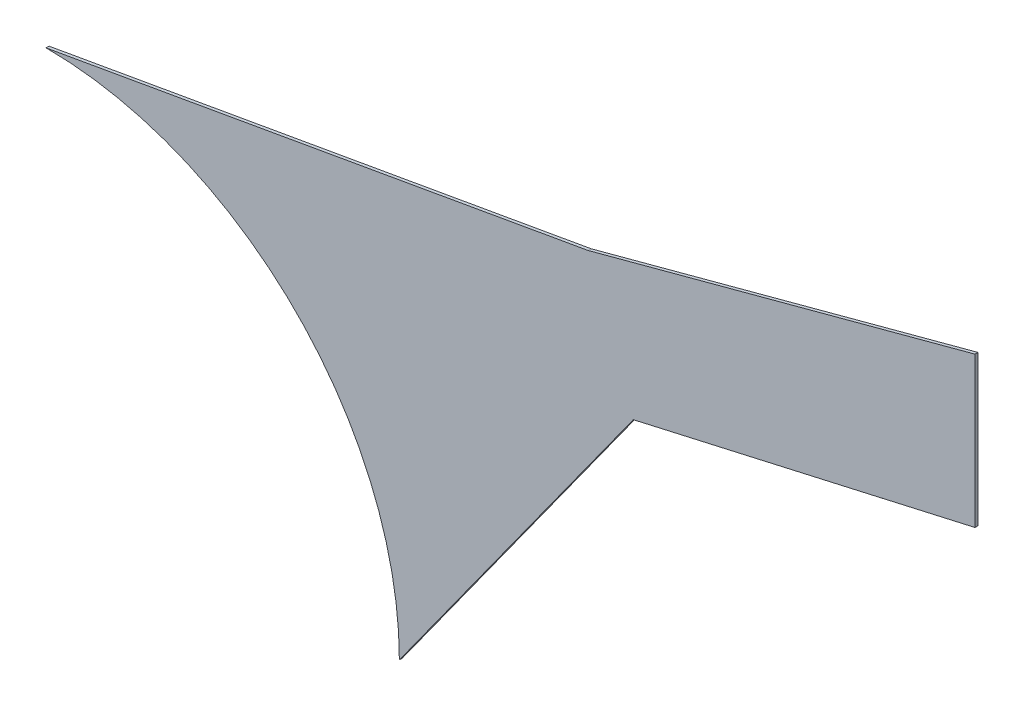
ISO-10303-21;
HEADER;
FILE_DESCRIPTION(('STEP AP214'),'2;1');
FILE_NAME('part.step','',(''),(''),'','','');
FILE_SCHEMA(('AUTOMOTIVE_DESIGN { 1 0 10303 214 1 1 1 1 }'));
ENDSEC;
DATA;
#1=APPLICATION_CONTEXT('core data for automotive mechanical design processes');
#2=APPLICATION_PROTOCOL_DEFINITION('international standard','automotive_design',2000,#1);
#3=PRODUCT_CONTEXT('',#1,'mechanical');
#4=PRODUCT('Part','Part','',(#3));
#5=PRODUCT_RELATED_PRODUCT_CATEGORY('part','',(#4));
#6=PRODUCT_DEFINITION_FORMATION('','',#4);
#7=PRODUCT_DEFINITION_CONTEXT('part definition',#1,'design');
#8=PRODUCT_DEFINITION('design','',#6,#7);
#9=PRODUCT_DEFINITION_SHAPE('','',#8);
#10=(LENGTH_UNIT() NAMED_UNIT(*) SI_UNIT(.MILLI.,.METRE.));
#11=(NAMED_UNIT(*) PLANE_ANGLE_UNIT() SI_UNIT($,.RADIAN.));
#12=(NAMED_UNIT(*) SI_UNIT($,.STERADIAN.) SOLID_ANGLE_UNIT());
#13=UNCERTAINTY_MEASURE_WITH_UNIT(LENGTH_MEASURE(1.E-05),#10,'distance_accuracy_value','');
#14=(GEOMETRIC_REPRESENTATION_CONTEXT(3) GLOBAL_UNCERTAINTY_ASSIGNED_CONTEXT((#13)) GLOBAL_UNIT_ASSIGNED_CONTEXT((#10,
#11,#12)) REPRESENTATION_CONTEXT('',''));
#15=CARTESIAN_POINT('',(0.,0.,0.));
#16=DIRECTION('',(0.,0.,1.));
#17=DIRECTION('',(1.,0.,0.));
#18=AXIS2_PLACEMENT_3D('',#15,#16,#17);
#19=CARTESIAN_POINT('',(471.43141409355,280.42825080497,1.51892));
#20=DIRECTION('',(0.258819045102512,-0.965925826289071,0.));
#21=DIRECTION('',(0.965925826289071,0.258819045102512,0.));
#22=AXIS2_PLACEMENT_3D('',#19,#20,#21);
#23=PLANE('',#22);
#24=DIRECTION('',(-0.965925826289071,-0.258819045102512,0.));
#25=VECTOR('',#24,1.);
#26=CARTESIAN_POINT('',(471.43141409355,280.42825080497,0.));
#27=LINE('',#26,#25);
#28=CARTESIAN_POINT('',(471.43141409355,280.42825080497,0.));
#29=VERTEX_POINT('',#28);
#30=CARTESIAN_POINT('',(275.155286191611,227.83622084014,0.));
#31=VERTEX_POINT('',#30);
#32=EDGE_CURVE('E128',#29,#31,#27,.T.);
#33=ORIENTED_EDGE('',*,*,#32,.T.);
#34=DIRECTION('',(0.,0.,-1.));
#35=VECTOR('',#34,1.);
#36=CARTESIAN_POINT('',(275.155286191611,227.83622084014,1.51892));
#37=LINE('',#36,#35);
#38=CARTESIAN_POINT('',(275.155286191611,227.83622084014,1.51892));
#39=VERTEX_POINT('',#38);
#40=EDGE_CURVE('E11',#39,#31,#37,.T.);
#41=ORIENTED_EDGE('',*,*,#40,.F.);
#42=DIRECTION('',(-0.965925826289071,-0.258819045102512,0.));
#43=VECTOR('',#42,1.);
#44=CARTESIAN_POINT('',(471.43141409355,280.42825080497,1.51892));
#45=LINE('',#44,#43);
#46=CARTESIAN_POINT('',(471.43141409355,280.42825080497,1.51892));
#47=VERTEX_POINT('',#46);
#48=EDGE_CURVE('E144',#47,#39,#45,.T.);
#49=ORIENTED_EDGE('',*,*,#48,.F.);
#50=DIRECTION('',(0.,0.,-1.));
#51=VECTOR('',#50,1.);
#52=CARTESIAN_POINT('',(471.43141409355,280.42825080497,1.51892));
#53=LINE('',#52,#51);
#54=EDGE_CURVE('E124',#47,#29,#53,.T.);
#55=ORIENTED_EDGE('',*,*,#54,.T.);
#56=EDGE_LOOP('',(#33,#41,#49,#55));
#57=FACE_BOUND('',#56,.T.);
#58=ADVANCED_FACE('F39',(#57),#23,.F.);
#59=CARTESIAN_POINT('',(0.,179.31892,1.51892));
#60=DIRECTION('',(0.173648177666928,-0.984807753012209,0.));
#61=DIRECTION('',(0.984807753012209,0.173648177666928,0.));
#62=AXIS2_PLACEMENT_3D('',#59,#60,#61);
#63=PLANE('',#62);
#64=DIRECTION('',(-0.984807753012209,-0.173648177666928,0.));
#65=VECTOR('',#64,1.);
#66=CARTESIAN_POINT('',(0.,179.31892,0.));
#67=LINE('',#66,#65);
#68=CARTESIAN_POINT('',(0.,179.31892,0.));
#69=VERTEX_POINT('',#68);
#70=EDGE_CURVE('E132',#31,#69,#67,.T.);
#71=ORIENTED_EDGE('',*,*,#70,.T.);
#72=DIRECTION('',(0.,0.,-1.));
#73=VECTOR('',#72,1.);
#74=CARTESIAN_POINT('',(0.,179.31892,1.51892));
#75=LINE('',#74,#73);
#76=CARTESIAN_POINT('',(0.,179.31892,1.51892));
#77=VERTEX_POINT('',#76);
#78=EDGE_CURVE('E48',#77,#69,#75,.T.);
#79=ORIENTED_EDGE('',*,*,#78,.F.);
#80=DIRECTION('',(-0.984807753012209,-0.173648177666928,0.));
#81=VECTOR('',#80,1.);
#82=CARTESIAN_POINT('',(0.,179.31892,1.51892));
#83=LINE('',#82,#81);
#84=EDGE_CURVE('E93',#39,#77,#83,.T.);
#85=ORIENTED_EDGE('',*,*,#84,.F.);
#86=ORIENTED_EDGE('',*,*,#40,.T.);
#87=EDGE_LOOP('',(#71,#79,#85,#86));
#88=FACE_BOUND('',#87,.T.);
#89=ADVANCED_FACE('F172',(#88),#63,.F.);
#90=CARTESIAN_POINT('',(0.,0.,1.51892));
#91=DIRECTION('',(0.,0.,-1.));
#92=DIRECTION('',(-1.,0.,0.));
#93=AXIS2_PLACEMENT_3D('',#90,#91,#92);
#94=CYLINDRICAL_SURFACE('',#93,179.31892);
#95=CARTESIAN_POINT('',(0.,0.,0.));
#96=DIRECTION('',(0.,0.,-1.));
#97=DIRECTION('',(-1.,0.,0.));
#98=AXIS2_PLACEMENT_3D('',#95,#96,#97);
#99=CIRCLE('',#98,179.31892);
#100=CARTESIAN_POINT('',(179.31892,0.,0.));
#101=VERTEX_POINT('',#100);
#102=EDGE_CURVE('E135',#69,#101,#99,.T.);
#103=ORIENTED_EDGE('',*,*,#102,.T.);
#104=DIRECTION('',(0.,0.,-1.));
#105=VECTOR('',#104,1.);
#106=CARTESIAN_POINT('',(179.31892,0.,1.51892));
#107=LINE('',#106,#105);
#108=CARTESIAN_POINT('',(179.31892,0.,1.51892));
#109=VERTEX_POINT('',#108);
#110=EDGE_CURVE('E117',#109,#101,#107,.T.);
#111=ORIENTED_EDGE('',*,*,#110,.F.);
#112=CARTESIAN_POINT('',(0.,0.,1.51892));
#113=DIRECTION('',(0.,0.,-1.));
#114=DIRECTION('',(-1.,0.,0.));
#115=AXIS2_PLACEMENT_3D('',#112,#113,#114);
#116=CIRCLE('',#115,179.31892);
#117=EDGE_CURVE('E106',#77,#109,#116,.T.);
#118=ORIENTED_EDGE('',*,*,#117,.F.);
#119=ORIENTED_EDGE('',*,*,#78,.T.);
#120=EDGE_LOOP('',(#103,#111,#118,#119));
#121=FACE_BOUND('',#120,.T.);
#122=ADVANCED_FACE('F154',(#121),#94,.F.);
#123=CARTESIAN_POINT('',(298.031766742279,164.916645667877,1.51892));
#124=DIRECTION('',(-0.811597665688373,0.584216765463971,0.));
#125=DIRECTION('',(-0.584216765463971,-0.811597665688373,0.));
#126=AXIS2_PLACEMENT_3D('',#123,#124,#125);
#127=PLANE('',#126);
#128=DIRECTION('',(0.58421676546397,0.811597665688373,0.));
#129=VECTOR('',#128,1.);
#130=CARTESIAN_POINT('',(298.031766742279,164.916645667877,0.));
#131=LINE('',#130,#129);
#132=CARTESIAN_POINT('',(298.031766742279,164.916645667877,0.));
#133=VERTEX_POINT('',#132);
#134=EDGE_CURVE('E115',#101,#133,#131,.T.);
#135=ORIENTED_EDGE('',*,*,#134,.T.);
#136=DIRECTION('',(0.,0.,-1.));
#137=VECTOR('',#136,1.);
#138=CARTESIAN_POINT('',(298.031766742279,164.916645667877,1.51892));
#139=LINE('',#138,#137);
#140=CARTESIAN_POINT('',(298.031766742279,164.916645667877,1.51892));
#141=VERTEX_POINT('',#140);
#142=EDGE_CURVE('E112',#141,#133,#139,.T.);
#143=ORIENTED_EDGE('',*,*,#142,.F.);
#144=DIRECTION('',(0.58421676546397,0.811597665688373,0.));
#145=VECTOR('',#144,1.);
#146=CARTESIAN_POINT('',(298.031766742279,164.916645667877,1.51892));
#147=LINE('',#146,#145);
#148=EDGE_CURVE('E100',#109,#141,#147,.T.);
#149=ORIENTED_EDGE('',*,*,#148,.F.);
#150=ORIENTED_EDGE('',*,*,#110,.T.);
#151=EDGE_LOOP('',(#135,#143,#149,#150));
#152=FACE_BOUND('',#151,.T.);
#153=ADVANCED_FACE('F113',(#152),#127,.F.);
#154=CARTESIAN_POINT('',(298.031766742279,164.916645667877,1.51892));
#155=DIRECTION('',(-0.221100141378473,0.975251109962157,0.));
#156=DIRECTION('',(-0.975251109962157,-0.221100141378473,0.));
#157=AXIS2_PLACEMENT_3D('',#154,#155,#156);
#158=PLANE('',#157);
#159=DIRECTION('',(0.975251109962157,0.221100141378473,0.));
#160=VECTOR('',#159,1.);
#161=CARTESIAN_POINT('',(298.031766742279,164.916645667877,0.));
#162=LINE('',#161,#160);
#163=CARTESIAN_POINT('',(471.43141409355,204.22825080497,0.));
#164=VERTEX_POINT('',#163);
#165=EDGE_CURVE('E79',#133,#164,#162,.T.);
#166=ORIENTED_EDGE('',*,*,#165,.T.);
#167=DIRECTION('',(0.,0.,-1.));
#168=VECTOR('',#167,1.);
#169=CARTESIAN_POINT('',(471.43141409355,204.22825080497,1.51892));
#170=LINE('',#169,#168);
#171=CARTESIAN_POINT('',(471.43141409355,204.22825080497,1.51892));
#172=VERTEX_POINT('',#171);
#173=EDGE_CURVE('E118',#172,#164,#170,.T.);
#174=ORIENTED_EDGE('',*,*,#173,.F.);
#175=DIRECTION('',(0.975251109962157,0.221100141378473,0.));
#176=VECTOR('',#175,1.);
#177=CARTESIAN_POINT('',(298.031766742279,164.916645667877,1.51892));
#178=LINE('',#177,#176);
#179=EDGE_CURVE('E104',#141,#172,#178,.T.);
#180=ORIENTED_EDGE('',*,*,#179,.F.);
#181=ORIENTED_EDGE('',*,*,#142,.T.);
#182=EDGE_LOOP('',(#166,#174,#180,#181));
#183=FACE_BOUND('',#182,.T.);
#184=ADVANCED_FACE('F120',(#183),#158,.F.);
#185=CARTESIAN_POINT('',(471.43141409355,204.22825080497,1.51892));
#186=DIRECTION('',(-1.,0.,0.));
#187=DIRECTION('',(0.,-1.,0.));
#188=AXIS2_PLACEMENT_3D('',#185,#186,#187);
#189=PLANE('',#188);
#190=DIRECTION('',(0.,1.,0.));
#191=VECTOR('',#190,1.);
#192=CARTESIAN_POINT('',(471.43141409355,204.22825080497,0.));
#193=LINE('',#192,#191);
#194=EDGE_CURVE('E85',#164,#29,#193,.T.);
#195=ORIENTED_EDGE('',*,*,#194,.T.);
#196=ORIENTED_EDGE('',*,*,#54,.F.);
#197=DIRECTION('',(0.,1.,0.));
#198=VECTOR('',#197,1.);
#199=CARTESIAN_POINT('',(471.43141409355,204.22825080497,1.51892));
#200=LINE('',#199,#198);
#201=EDGE_CURVE('E56',#172,#47,#200,.T.);
#202=ORIENTED_EDGE('',*,*,#201,.F.);
#203=ORIENTED_EDGE('',*,*,#173,.T.);
#204=EDGE_LOOP('',(#195,#196,#202,#203));
#205=FACE_BOUND('',#204,.T.);
#206=ADVANCED_FACE('F161',(#205),#189,.F.);
#207=CARTESIAN_POINT('',(0.,0.,1.51892));
#208=DIRECTION('',(0.,0.,-1.));
#209=DIRECTION('',(-1.,0.,0.));
#210=AXIS2_PLACEMENT_3D('',#207,#208,#209);
#211=PLANE('',#210);
#212=ORIENTED_EDGE('',*,*,#48,.T.);
#213=ORIENTED_EDGE('',*,*,#84,.T.);
#214=ORIENTED_EDGE('',*,*,#117,.T.);
#215=ORIENTED_EDGE('',*,*,#148,.T.);
#216=ORIENTED_EDGE('',*,*,#179,.T.);
#217=ORIENTED_EDGE('',*,*,#201,.T.);
#218=EDGE_LOOP('',(#212,#213,#214,#215,#216,#217));
#219=FACE_BOUND('',#218,.T.);
#220=ADVANCED_FACE('F102',(#219),#211,.F.);
#221=CARTESIAN_POINT('',(0.,0.,0.));
#222=DIRECTION('',(0.,0.,-1.));
#223=DIRECTION('',(-1.,0.,0.));
#224=AXIS2_PLACEMENT_3D('',#221,#222,#223);
#225=PLANE('',#224);
#226=ORIENTED_EDGE('',*,*,#32,.F.);
#227=ORIENTED_EDGE('',*,*,#194,.F.);
#228=ORIENTED_EDGE('',*,*,#165,.F.);
#229=ORIENTED_EDGE('',*,*,#134,.F.);
#230=ORIENTED_EDGE('',*,*,#102,.F.);
#231=ORIENTED_EDGE('',*,*,#70,.F.);
#232=EDGE_LOOP('',(#226,#227,#228,#229,#230,#231));
#233=FACE_BOUND('',#232,.T.);
#234=ADVANCED_FACE('F157',(#233),#225,.T.);
#235=CLOSED_SHELL('',(#58,#89,#122,#153,#184,#206,#220,#234));
#236=MANIFOLD_SOLID_BREP('B2',#235);
#237=ADVANCED_BREP_SHAPE_REPRESENTATION('',(#18,#236),#14);
#238=SHAPE_DEFINITION_REPRESENTATION(#9,#237);
ENDSEC;
END-ISO-10303-21;
